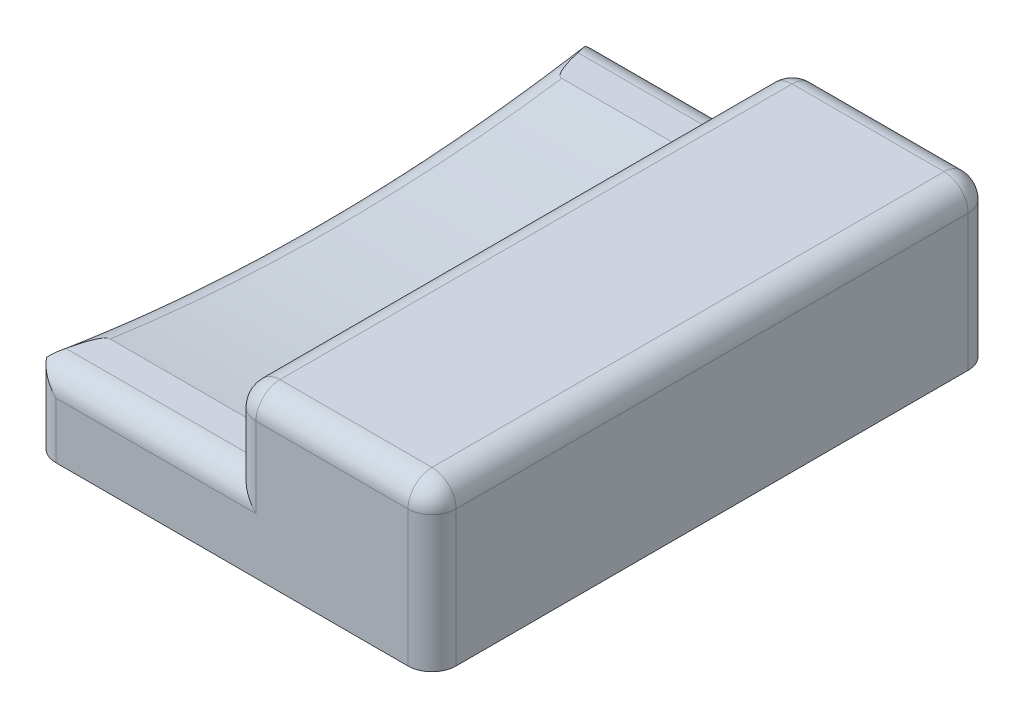
ISO-10303-21;
HEADER;
FILE_DESCRIPTION(('STEP AP214'),'2;1');
FILE_NAME('part.step','',(''),(''),'','','');
FILE_SCHEMA(('AUTOMOTIVE_DESIGN { 1 0 10303 214 1 1 1 1 }'));
ENDSEC;
DATA;
#1=APPLICATION_CONTEXT('core data for automotive mechanical design processes');
#2=APPLICATION_PROTOCOL_DEFINITION('international standard','automotive_design',2000,#1);
#3=PRODUCT_CONTEXT('',#1,'mechanical');
#4=PRODUCT('Part','Part','',(#3));
#5=PRODUCT_RELATED_PRODUCT_CATEGORY('part','',(#4));
#6=PRODUCT_DEFINITION_FORMATION('','',#4);
#7=PRODUCT_DEFINITION_CONTEXT('part definition',#1,'design');
#8=PRODUCT_DEFINITION('design','',#6,#7);
#9=PRODUCT_DEFINITION_SHAPE('','',#8);
#10=(LENGTH_UNIT() NAMED_UNIT(*) SI_UNIT(.MILLI.,.METRE.));
#11=(NAMED_UNIT(*) PLANE_ANGLE_UNIT() SI_UNIT($,.RADIAN.));
#12=(NAMED_UNIT(*) SI_UNIT($,.STERADIAN.) SOLID_ANGLE_UNIT());
#13=UNCERTAINTY_MEASURE_WITH_UNIT(LENGTH_MEASURE(1.E-05),#10,'distance_accuracy_value','');
#14=(GEOMETRIC_REPRESENTATION_CONTEXT(3) GLOBAL_UNCERTAINTY_ASSIGNED_CONTEXT((#13)) GLOBAL_UNIT_ASSIGNED_CONTEXT((#10,
#11,#12)) REPRESENTATION_CONTEXT('',''));
#15=CARTESIAN_POINT('',(0.,0.,0.));
#16=DIRECTION('',(0.,0.,1.));
#17=DIRECTION('',(1.,0.,0.));
#18=AXIS2_PLACEMENT_3D('',#15,#16,#17);
#19=CARTESIAN_POINT('',(0.,20.,0.));
#20=DIRECTION('',(0.,-1.,0.));
#21=DIRECTION('',(0.,0.,-1.));
#22=AXIS2_PLACEMENT_3D('',#19,#20,#21);
#23=PLANE('',#22);
#24=DIRECTION('',(0.,0.,-1.));
#25=VECTOR('',#24,1.);
#26=CARTESIAN_POINT('',(47.,20.,0.));
#27=LINE('',#26,#25);
#28=CARTESIAN_POINT('',(47.,20.,-3.));
#29=VERTEX_POINT('',#28);
#30=CARTESIAN_POINT('',(47.,20.,-67.));
#31=VERTEX_POINT('',#30);
#32=EDGE_CURVE('E351',#29,#31,#27,.T.);
#33=ORIENTED_EDGE('',*,*,#32,.T.);
#34=DIRECTION('',(-1.,0.,0.));
#35=VECTOR('',#34,1.);
#36=CARTESIAN_POINT('',(0.,20.,-67.));
#37=LINE('',#36,#35);
#38=CARTESIAN_POINT('',(28.,20.,-67.));
#39=VERTEX_POINT('',#38);
#40=EDGE_CURVE('E353',#31,#39,#37,.T.);
#41=ORIENTED_EDGE('',*,*,#40,.T.);
#42=DIRECTION('',(0.,0.,-1.));
#43=VECTOR('',#42,1.);
#44=CARTESIAN_POINT('',(28.,20.,0.));
#45=LINE('',#44,#43);
#46=CARTESIAN_POINT('',(28.,20.,-3.));
#47=VERTEX_POINT('',#46);
#48=EDGE_CURVE('E344',#39,#47,#45,.F.);
#49=ORIENTED_EDGE('',*,*,#48,.T.);
#50=DIRECTION('',(1.,0.,0.));
#51=VECTOR('',#50,1.);
#52=CARTESIAN_POINT('',(0.,20.,-3.));
#53=LINE('',#52,#51);
#54=EDGE_CURVE('E349',#47,#29,#53,.T.);
#55=ORIENTED_EDGE('',*,*,#54,.T.);
#56=EDGE_LOOP('',(#33,#41,#49,#55));
#57=FACE_BOUND('',#56,.T.);
#58=ADVANCED_FACE('F33',(#57),#23,.F.);
#59=CARTESIAN_POINT('',(0.,20.,0.));
#60=DIRECTION('',(1.,0.,0.));
#61=DIRECTION('',(0.,0.,-1.));
#62=AXIS2_PLACEMENT_3D('',#59,#60,#61);
#63=PLANE('',#62);
#64=DIRECTION('',(0.,0.,1.));
#65=VECTOR('',#64,1.);
#66=CARTESIAN_POINT('',(0.,0.,0.));
#67=LINE('',#66,#65);
#68=CARTESIAN_POINT('',(0.,0.,-67.));
#69=VERTEX_POINT('',#68);
#70=CARTESIAN_POINT('',(0.,0.,-3.));
#71=VERTEX_POINT('',#70);
#72=EDGE_CURVE('E173',#69,#71,#67,.T.);
#73=ORIENTED_EDGE('',*,*,#72,.T.);
#74=DIRECTION('',(0.,-1.,0.));
#75=VECTOR('',#74,1.);
#76=CARTESIAN_POINT('',(0.,20.,-3.));
#77=LINE('',#76,#75);
#78=CARTESIAN_POINT('',(0.,7.53803353254265,-3.));
#79=VERTEX_POINT('',#78);
#80=EDGE_CURVE('E52',#71,#79,#77,.F.);
#81=ORIENTED_EDGE('',*,*,#80,.T.);
#82=CARTESIAN_POINT('',(0.,208.,-35.));
#83=DIRECTION('',(1.,0.,0.));
#84=DIRECTION('',(0.,0.,-1.));
#85=AXIS2_PLACEMENT_3D('',#82,#83,#84);
#86=CIRCLE('',#85,203.);
#87=CARTESIAN_POINT('',(0.,7.53803353254265,-67.));
#88=VERTEX_POINT('',#87);
#89=EDGE_CURVE('E186',#79,#88,#86,.T.);
#90=ORIENTED_EDGE('',*,*,#89,.T.);
#91=DIRECTION('',(0.,-1.,0.));
#92=VECTOR('',#91,1.);
#93=CARTESIAN_POINT('',(0.,20.,-67.));
#94=LINE('',#93,#92);
#95=EDGE_CURVE('E178',#88,#69,#94,.T.);
#96=ORIENTED_EDGE('',*,*,#95,.T.);
#97=EDGE_LOOP('',(#73,#81,#90,#96));
#98=FACE_BOUND('',#97,.T.);
#99=ADVANCED_FACE('F177',(#98),#63,.F.);
#100=CARTESIAN_POINT('',(0.,20.,0.));
#101=DIRECTION('',(0.,0.,-1.));
#102=DIRECTION('',(-1.,0.,0.));
#103=AXIS2_PLACEMENT_3D('',#100,#101,#102);
#104=PLANE('',#103);
#105=DIRECTION('',(-1.,0.,0.));
#106=VECTOR('',#105,1.);
#107=CARTESIAN_POINT('',(0.,7.,0.));
#108=LINE('',#107,#106);
#109=CARTESIAN_POINT('',(28.,7.,0.));
#110=VERTEX_POINT('',#109);
#111=CARTESIAN_POINT('',(3.,7.,0.));
#112=VERTEX_POINT('',#111);
#113=EDGE_CURVE('E375',#110,#112,#108,.T.);
#114=ORIENTED_EDGE('',*,*,#113,.T.);
#115=DIRECTION('',(0.,-1.,0.));
#116=VECTOR('',#115,1.);
#117=CARTESIAN_POINT('',(3.,20.,0.));
#118=LINE('',#117,#116);
#119=CARTESIAN_POINT('',(3.,0.,0.));
#120=VERTEX_POINT('',#119);
#121=EDGE_CURVE('E377',#112,#120,#118,.T.);
#122=ORIENTED_EDGE('',*,*,#121,.T.);
#123=DIRECTION('',(1.,0.,0.));
#124=VECTOR('',#123,1.);
#125=CARTESIAN_POINT('',(0.,0.,0.));
#126=LINE('',#125,#124);
#127=CARTESIAN_POINT('',(47.,0.,0.));
#128=VERTEX_POINT('',#127);
#129=EDGE_CURVE('E176',#120,#128,#126,.T.);
#130=ORIENTED_EDGE('',*,*,#129,.T.);
#131=DIRECTION('',(0.,-1.,0.));
#132=VECTOR('',#131,1.);
#133=CARTESIAN_POINT('',(47.,20.,0.));
#134=LINE('',#133,#132);
#135=CARTESIAN_POINT('',(47.,17.,0.));
#136=VERTEX_POINT('',#135);
#137=EDGE_CURVE('E369',#128,#136,#134,.F.);
#138=ORIENTED_EDGE('',*,*,#137,.T.);
#139=DIRECTION('',(1.,0.,0.));
#140=VECTOR('',#139,1.);
#141=CARTESIAN_POINT('',(0.,17.,0.));
#142=LINE('',#141,#140);
#143=CARTESIAN_POINT('',(28.,17.,0.));
#144=VERTEX_POINT('',#143);
#145=EDGE_CURVE('E371',#136,#144,#142,.F.);
#146=ORIENTED_EDGE('',*,*,#145,.T.);
#147=DIRECTION('',(0.,1.,0.));
#148=VECTOR('',#147,1.);
#149=CARTESIAN_POINT('',(28.,10.,0.));
#150=LINE('',#149,#148);
#151=EDGE_CURVE('E373',#144,#110,#150,.F.);
#152=ORIENTED_EDGE('',*,*,#151,.T.);
#153=EDGE_LOOP('',(#114,#122,#130,#138,#146,#152));
#154=FACE_BOUND('',#153,.T.);
#155=ADVANCED_FACE('F288',(#154),#104,.F.);
#156=CARTESIAN_POINT('',(50.,20.,0.));
#157=DIRECTION('',(-1.,0.,0.));
#158=DIRECTION('',(0.,0.,1.));
#159=AXIS2_PLACEMENT_3D('',#156,#157,#158);
#160=PLANE('',#159);
#161=DIRECTION('',(0.,0.,-1.));
#162=VECTOR('',#161,1.);
#163=CARTESIAN_POINT('',(50.,0.,0.));
#164=LINE('',#163,#162);
#165=CARTESIAN_POINT('',(50.,0.,-3.));
#166=VERTEX_POINT('',#165);
#167=CARTESIAN_POINT('',(50.,0.,-67.));
#168=VERTEX_POINT('',#167);
#169=EDGE_CURVE('E336',#166,#168,#164,.T.);
#170=ORIENTED_EDGE('',*,*,#169,.T.);
#171=DIRECTION('',(0.,-1.,0.));
#172=VECTOR('',#171,1.);
#173=CARTESIAN_POINT('',(50.,20.,-67.));
#174=LINE('',#173,#172);
#175=CARTESIAN_POINT('',(50.,17.,-67.));
#176=VERTEX_POINT('',#175);
#177=EDGE_CURVE('E332',#168,#176,#174,.F.);
#178=ORIENTED_EDGE('',*,*,#177,.T.);
#179=DIRECTION('',(0.,0.,-1.));
#180=VECTOR('',#179,1.);
#181=CARTESIAN_POINT('',(50.,17.,0.));
#182=LINE('',#181,#180);
#183=CARTESIAN_POINT('',(50.,17.,-3.));
#184=VERTEX_POINT('',#183);
#185=EDGE_CURVE('E366',#176,#184,#182,.F.);
#186=ORIENTED_EDGE('',*,*,#185,.T.);
#187=DIRECTION('',(0.,-1.,0.));
#188=VECTOR('',#187,1.);
#189=CARTESIAN_POINT('',(50.,20.,-3.));
#190=LINE('',#189,#188);
#191=EDGE_CURVE('E342',#184,#166,#190,.T.);
#192=ORIENTED_EDGE('',*,*,#191,.T.);
#193=EDGE_LOOP('',(#170,#178,#186,#192));
#194=FACE_BOUND('',#193,.T.);
#195=ADVANCED_FACE('F284',(#194),#160,.F.);
#196=CARTESIAN_POINT('',(0.,20.,-70.));
#197=DIRECTION('',(0.,0.,1.));
#198=DIRECTION('',(1.,0.,0.));
#199=AXIS2_PLACEMENT_3D('',#196,#197,#198);
#200=PLANE('',#199);
#201=DIRECTION('',(-1.,0.,0.));
#202=VECTOR('',#201,1.);
#203=CARTESIAN_POINT('',(0.,0.,-70.));
#204=LINE('',#203,#202);
#205=CARTESIAN_POINT('',(47.,0.,-70.));
#206=VERTEX_POINT('',#205);
#207=CARTESIAN_POINT('',(3.,0.,-70.));
#208=VERTEX_POINT('',#207);
#209=EDGE_CURVE('E339',#206,#208,#204,.T.);
#210=ORIENTED_EDGE('',*,*,#209,.T.);
#211=DIRECTION('',(0.,-1.,0.));
#212=VECTOR('',#211,1.);
#213=CARTESIAN_POINT('',(3.,20.,-70.));
#214=LINE('',#213,#212);
#215=CARTESIAN_POINT('',(3.,7.,-70.));
#216=VERTEX_POINT('',#215);
#217=EDGE_CURVE('E363',#208,#216,#214,.F.);
#218=ORIENTED_EDGE('',*,*,#217,.T.);
#219=DIRECTION('',(-1.,0.,0.));
#220=VECTOR('',#219,1.);
#221=CARTESIAN_POINT('',(0.,7.,-70.));
#222=LINE('',#221,#220);
#223=CARTESIAN_POINT('',(28.,7.,-70.));
#224=VERTEX_POINT('',#223);
#225=EDGE_CURVE('E361',#216,#224,#222,.F.);
#226=ORIENTED_EDGE('',*,*,#225,.T.);
#227=DIRECTION('',(0.,-1.,0.));
#228=VECTOR('',#227,1.);
#229=CARTESIAN_POINT('',(28.,20.,-70.));
#230=LINE('',#229,#228);
#231=CARTESIAN_POINT('',(28.,17.,-70.));
#232=VERTEX_POINT('',#231);
#233=EDGE_CURVE('E359',#224,#232,#230,.F.);
#234=ORIENTED_EDGE('',*,*,#233,.T.);
#235=DIRECTION('',(-1.,0.,0.));
#236=VECTOR('',#235,1.);
#237=CARTESIAN_POINT('',(0.,17.,-70.));
#238=LINE('',#237,#236);
#239=CARTESIAN_POINT('',(47.,17.,-70.));
#240=VERTEX_POINT('',#239);
#241=EDGE_CURVE('E357',#232,#240,#238,.F.);
#242=ORIENTED_EDGE('',*,*,#241,.T.);
#243=DIRECTION('',(0.,-1.,0.));
#244=VECTOR('',#243,1.);
#245=CARTESIAN_POINT('',(47.,20.,-70.));
#246=LINE('',#245,#244);
#247=EDGE_CURVE('E330',#240,#206,#246,.T.);
#248=ORIENTED_EDGE('',*,*,#247,.T.);
#249=EDGE_LOOP('',(#210,#218,#226,#234,#242,#248));
#250=FACE_BOUND('',#249,.T.);
#251=ADVANCED_FACE('F281',(#250),#200,.F.);
#252=CARTESIAN_POINT('',(0.,0.,0.));
#253=DIRECTION('',(0.,-1.,0.));
#254=DIRECTION('',(0.,0.,-1.));
#255=AXIS2_PLACEMENT_3D('',#252,#253,#254);
#256=PLANE('',#255);
#257=ORIENTED_EDGE('',*,*,#129,.F.);
#258=CARTESIAN_POINT('',(3.,0.,-3.));
#259=DIRECTION('',(0.,-1.,0.));
#260=DIRECTION('',(0.,0.,-1.));
#261=AXIS2_PLACEMENT_3D('',#258,#259,#260);
#262=CIRCLE('',#261,3.);
#263=EDGE_CURVE('E11',#120,#71,#262,.T.);
#264=ORIENTED_EDGE('',*,*,#263,.T.);
#265=ORIENTED_EDGE('',*,*,#72,.F.);
#266=CARTESIAN_POINT('',(3.,0.,-67.));
#267=DIRECTION('',(0.,-1.,0.));
#268=DIRECTION('',(0.,0.,-1.));
#269=AXIS2_PLACEMENT_3D('',#266,#267,#268);
#270=CIRCLE('',#269,3.);
#271=EDGE_CURVE('E43',#69,#208,#270,.T.);
#272=ORIENTED_EDGE('',*,*,#271,.T.);
#273=ORIENTED_EDGE('',*,*,#209,.F.);
#274=CARTESIAN_POINT('',(47.,0.,-67.));
#275=DIRECTION('',(0.,-1.,0.));
#276=DIRECTION('',(0.,0.,-1.));
#277=AXIS2_PLACEMENT_3D('',#274,#275,#276);
#278=CIRCLE('',#277,3.);
#279=EDGE_CURVE('E188',#206,#168,#278,.T.);
#280=ORIENTED_EDGE('',*,*,#279,.T.);
#281=ORIENTED_EDGE('',*,*,#169,.F.);
#282=CARTESIAN_POINT('',(47.,0.,-3.));
#283=DIRECTION('',(0.,-1.,0.));
#284=DIRECTION('',(0.,0.,-1.));
#285=AXIS2_PLACEMENT_3D('',#282,#283,#284);
#286=CIRCLE('',#285,3.);
#287=EDGE_CURVE('E185',#166,#128,#286,.T.);
#288=ORIENTED_EDGE('',*,*,#287,.T.);
#289=EDGE_LOOP('',(#257,#264,#265,#272,#273,#280,#281,#288));
#290=FACE_BOUND('',#289,.T.);
#291=ADVANCED_FACE('F172',(#290),#256,.T.);
#292=CARTESIAN_POINT('',(25.,10.,-6.78652804066815));
#293=DIRECTION('',(0.,-1.,0.));
#294=DIRECTION('',(0.,0.,-1.));
#295=AXIS2_PLACEMENT_3D('',#292,#293,#294);
#296=PLANE('',#295);
#297=DIRECTION('',(-1.,0.,0.));
#298=VECTOR('',#297,1.);
#299=CARTESIAN_POINT('',(25.,10.,-6.78652804066815));
#300=LINE('',#299,#298);
#301=CARTESIAN_POINT('',(25.,10.,-6.78652804066815));
#302=VERTEX_POINT('',#301);
#303=CARTESIAN_POINT('',(3.,10.,-6.78652804066815));
#304=VERTEX_POINT('',#303);
#305=EDGE_CURVE('E179',#302,#304,#300,.T.);
#306=ORIENTED_EDGE('',*,*,#305,.T.);
#307=CARTESIAN_POINT('',(3.,10.,-6.78652804066815));
#308=CARTESIAN_POINT('',(2.97283767023564,10.,-6.78661603657435));
#309=CARTESIAN_POINT('',(2.94580219402082,10.,-6.78391685426819));
#310=CARTESIAN_POINT('',(2.89300564850904,10.,-6.77378992579364));
#311=CARTESIAN_POINT('',(2.86723202972162,10.,-6.76642897124706));
#312=CARTESIAN_POINT('',(2.80960341439848,10.,-6.74495909459089));
#313=CARTESIAN_POINT('',(2.77827087085583,10.,-6.72948161370137));
#314=CARTESIAN_POINT('',(2.7182941755811,10.,-6.69378518835798));
#315=CARTESIAN_POINT('',(2.68966780819925,10.,-6.67353757210311));
#316=CARTESIAN_POINT('',(2.61178291480033,10.,-6.61132868940785));
#317=CARTESIAN_POINT('',(2.56564294156609,10.,-6.56552764330699));
#318=CARTESIAN_POINT('',(2.47981348219681,10.,-6.46835344776558));
#319=CARTESIAN_POINT('',(2.44014210794988,10.,-6.4169653022757));
#320=CARTESIAN_POINT('',(2.33787110231278,10.,-6.27190757709554));
#321=CARTESIAN_POINT('',(2.27992768049093,10.,-6.17499474692295));
#322=CARTESIAN_POINT('',(2.17252568012461,10.,-5.97650659122865));
#323=CARTESIAN_POINT('',(2.12309006517863,10.,-5.87491955676449));
#324=CARTESIAN_POINT('',(2.02968253686925,10.,-5.66799914976688));
#325=CARTESIAN_POINT('',(1.98577307424686,10.,-5.56263773241506));
#326=CARTESIAN_POINT('',(1.9024650754644,10.,-5.3503438842432));
#327=CARTESIAN_POINT('',(1.8630604267874,10.,-5.24341380980297));
#328=CARTESIAN_POINT('',(1.78754811326613,10.,-5.02796766786654));
#329=CARTESIAN_POINT('',(1.7514529121765,10.,-4.91944725754414));
#330=CARTESIAN_POINT('',(1.68204327410568,10.,-4.70151720354438));
#331=CARTESIAN_POINT('',(1.64872908306333,10.,-4.59210748215766));
#332=CARTESIAN_POINT('',(1.55219160612783,10.,-4.26280127787498));
#333=CARTESIAN_POINT('',(1.49239780659943,10.,-4.04189971793224));
#334=CARTESIAN_POINT('',(1.37936058130509,10.,-3.5978761625082));
#335=CARTESIAN_POINT('',(1.32613376559537,10.,-3.37475001941122));
#336=CARTESIAN_POINT('',(1.2249869854251,10.,-2.92735052826522));
#337=CARTESIAN_POINT('',(1.17706596713405,10.,-2.70307741731675));
#338=CARTESIAN_POINT('',(1.08941206435251,10.,-2.27245748589464));
#339=CARTESIAN_POINT('',(1.04932955413873,10.,-2.06618127235464));
#340=CARTESIAN_POINT('',(0.972330775477108,10.,-1.65302662456499));
#341=CARTESIAN_POINT('',(0.935414710184256,10.,-1.44614815255433));
#342=CARTESIAN_POINT('',(0.86456279054743,10.,-1.03293815385267));
#343=CARTESIAN_POINT('',(0.830613081580195,10.,-0.826608992908559));
#344=CARTESIAN_POINT('',(0.765244403892852,10.,-0.413574310499643));
#345=CARTESIAN_POINT('',(0.733825140389053,10.,-0.206868835750714));
#346=CARTESIAN_POINT('',(0.703544247119797,10.,0.));
#347=B_SPLINE_CURVE_WITH_KNOTS('',3,(#307,#308,#309,#310,#311,#312,#313,#314,#315,#316,#317,
#318,#319,#320,#321,#322,#323,#324,#325,#326,#327,#328,#329,#330,#331,#332,#333,#334,#335,#336,
#337,#338,#339,#340,#341,#342,#343,#344,#345,#346),.UNSPECIFIED.,.F.,.F.,(4,2,2,2,2,2,2,2,2,2,2,
2,2,2,2,2,2,2,2,4),(0.,0.0811494733582297,0.161161795198234,0.265408286052778,0.370298119367736,
0.564244449667606,0.758724829978621,1.09657047745385,1.43531417694195,1.77759548339796,
2.11940669807651,2.46245644283548,2.80553649315702,3.49192434182628,4.18001416905984,
4.86796708269809,5.4983436138826,6.12876055900249,6.75605522475575,7.38327670793251),.UNSPECIFIED.);
#348=CARTESIAN_POINT('',(1.24182963864534,10.,-3.));
#349=VERTEX_POINT('',#348);
#350=EDGE_CURVE('E419',#304,#349,#347,.T.);
#351=ORIENTED_EDGE('',*,*,#350,.T.);
#352=DIRECTION('',(-1.,0.,0.));
#353=VECTOR('',#352,1.);
#354=CARTESIAN_POINT('',(25.,10.,-3.));
#355=LINE('',#354,#353);
#356=CARTESIAN_POINT('',(25.,10.,-3.));
#357=VERTEX_POINT('',#356);
#358=EDGE_CURVE('E415',#349,#357,#355,.F.);
#359=ORIENTED_EDGE('',*,*,#358,.T.);
#360=DIRECTION('',(0.,0.,1.));
#361=VECTOR('',#360,1.);
#362=CARTESIAN_POINT('',(25.,10.,-6.78652804066815));
#363=LINE('',#362,#361);
#364=EDGE_CURVE('E387',#302,#357,#363,.T.);
#365=ORIENTED_EDGE('',*,*,#364,.F.);
#366=EDGE_LOOP('',(#306,#351,#359,#365));
#367=FACE_BOUND('',#366,.T.);
#368=ADVANCED_FACE('F280',(#367),#296,.F.);
#369=CARTESIAN_POINT('',(25.,208.,-35.));
#370=DIRECTION('',(-1.,0.,0.));
#371=DIRECTION('',(0.,0.,1.));
#372=AXIS2_PLACEMENT_3D('',#369,#370,#371);
#373=CYLINDRICAL_SURFACE('',#372,200.);
#374=DIRECTION('',(-1.,0.,0.));
#375=VECTOR('',#374,1.);
#376=CARTESIAN_POINT('',(25.,10.,-63.2134719593319));
#377=LINE('',#376,#375);
#378=CARTESIAN_POINT('',(25.,10.,-63.2134719593319));
#379=VERTEX_POINT('',#378);
#380=CARTESIAN_POINT('',(3.,10.,-63.2134719593319));
#381=VERTEX_POINT('',#380);
#382=EDGE_CURVE('E409',#379,#381,#377,.T.);
#383=ORIENTED_EDGE('',*,*,#382,.T.);
#384=CARTESIAN_POINT('',(3.,208.,-35.));
#385=DIRECTION('',(1.,0.,0.));
#386=DIRECTION('',(0.,0.,-1.));
#387=AXIS2_PLACEMENT_3D('',#384,#385,#386);
#388=CIRCLE('',#387,200.);
#389=EDGE_CURVE('E414',#381,#304,#388,.F.);
#390=ORIENTED_EDGE('',*,*,#389,.T.);
#391=ORIENTED_EDGE('',*,*,#305,.F.);
#392=CARTESIAN_POINT('',(25.,208.,-35.));
#393=DIRECTION('',(-1.,0.,0.));
#394=DIRECTION('',(0.,0.,1.));
#395=AXIS2_PLACEMENT_3D('',#392,#393,#394);
#396=CIRCLE('',#395,200.);
#397=EDGE_CURVE('E411',#379,#302,#396,.T.);
#398=ORIENTED_EDGE('',*,*,#397,.F.);
#399=EDGE_LOOP('',(#383,#390,#391,#398));
#400=FACE_BOUND('',#399,.T.);
#401=ADVANCED_FACE('F272',(#400),#373,.F.);
#402=CARTESIAN_POINT('',(25.,10.,-70.));
#403=DIRECTION('',(0.,-1.,0.));
#404=DIRECTION('',(0.,0.,-1.));
#405=AXIS2_PLACEMENT_3D('',#402,#403,#404);
#406=PLANE('',#405);
#407=DIRECTION('',(0.,0.,1.));
#408=VECTOR('',#407,1.);
#409=CARTESIAN_POINT('',(25.,10.,-70.));
#410=LINE('',#409,#408);
#411=CARTESIAN_POINT('',(25.,10.,-67.));
#412=VERTEX_POINT('',#411);
#413=EDGE_CURVE('E78',#412,#379,#410,.T.);
#414=ORIENTED_EDGE('',*,*,#413,.F.);
#415=DIRECTION('',(-1.,0.,0.));
#416=VECTOR('',#415,1.);
#417=CARTESIAN_POINT('',(25.,10.,-67.));
#418=LINE('',#417,#416);
#419=CARTESIAN_POINT('',(1.24182963864531,10.,-67.));
#420=VERTEX_POINT('',#419);
#421=EDGE_CURVE('E262',#412,#420,#418,.T.);
#422=ORIENTED_EDGE('',*,*,#421,.T.);
#423=CARTESIAN_POINT('',(0.703544247119774,10.,-70.));
#424=CARTESIAN_POINT('',(0.738889751628962,10.,-69.7585972411166));
#425=CARTESIAN_POINT('',(0.775772333086899,10.,-69.517412815705));
#426=CARTESIAN_POINT('',(0.853051724983094,10.,-69.0354981915219));
#427=CARTESIAN_POINT('',(0.89345009790264,10.,-68.7947682437861));
#428=CARTESIAN_POINT('',(0.978815371367867,10.,-68.3103355142689));
#429=CARTESIAN_POINT('',(1.02384247226395,10.,-68.0666432840409));
#430=CARTESIAN_POINT('',(1.11860353964783,10.,-67.5802548583238));
#431=CARTESIAN_POINT('',(1.16833591179811,10.,-67.3375583543183));
#432=CARTESIAN_POINT('',(1.27578837131271,10.,-66.8429608689673));
#433=CARTESIAN_POINT('',(1.33376044643477,10.,-66.5911143288256));
#434=CARTESIAN_POINT('',(1.45775189597145,10.,-66.0890977675977));
#435=CARTESIAN_POINT('',(1.52377927920613,10.,-65.838929680237));
#436=CARTESIAN_POINT('',(1.630992582249,10.,-65.4669470123747));
#437=CARTESIAN_POINT('',(1.66795143830759,10.,-65.3439152194062));
#438=CARTESIAN_POINT('',(1.74530416995692,10.,-65.0989414610632));
#439=CARTESIAN_POINT('',(1.78569762352677,10.,-64.9769993638232));
#440=CARTESIAN_POINT('',(1.87079882984268,10.,-64.7348419104917));
#441=CARTESIAN_POINT('',(1.91549955973691,10.,-64.6146240988054));
#442=CARTESIAN_POINT('',(2.01072012919107,10.,-64.3765330079379));
#443=CARTESIAN_POINT('',(2.0612364084338,10.,-64.2586583455599));
#444=CARTESIAN_POINT('',(2.13183843587036,10.,-64.1091776698356));
#445=CARTESIAN_POINT('',(2.14806244320511,10.,-64.0757457780356));
#446=CARTESIAN_POINT('',(2.18133176336422,10.,-64.009286385595));
#447=CARTESIAN_POINT('',(2.19837724058061,10.,-63.9762589675699));
#448=CARTESIAN_POINT('',(2.25101258940976,10.,-63.8777100580281));
#449=CARTESIAN_POINT('',(2.28801008835622,10.,-63.8129188524907));
#450=CARTESIAN_POINT('',(2.3700062327303,10.,-63.6816376285934));
#451=CARTESIAN_POINT('',(2.41539926555757,10.,-63.6153927269935));
#452=CARTESIAN_POINT('',(2.51452331391885,10.,-63.4894570068946));
#453=CARTESIAN_POINT('',(2.56820928626041,10.,-63.4297335936122));
#454=CARTESIAN_POINT('',(2.65265070956419,10.,-63.3554513658835));
#455=CARTESIAN_POINT('',(2.67820217892395,10.,-63.3350633067508));
#456=CARTESIAN_POINT('',(2.73173042034892,10.,-63.2976941113008));
#457=CARTESIAN_POINT('',(2.75970564519636,10.,-63.2807108241454));
#458=CARTESIAN_POINT('',(2.8127934974033,10.,-63.2542132804971));
#459=CARTESIAN_POINT('',(2.8375019120717,10.,-63.2439024699125));
#460=CARTESIAN_POINT('',(2.88824718867137,10.,-63.2274787262937));
#461=CARTESIAN_POINT('',(2.91427986208371,10.,-63.2213533462099));
#462=CARTESIAN_POINT('',(2.96029581322912,10.,-63.2148625346229));
#463=CARTESIAN_POINT('',(2.98013452389799,10.,-63.2134286752728));
#464=CARTESIAN_POINT('',(2.99999999999999,10.,-63.2134719593318));
#465=B_SPLINE_CURVE_WITH_KNOTS('',3,(#423,#424,#425,#426,#427,#428,#429,#430,#431,#432,#433,
#434,#435,#436,#437,#438,#439,#440,#441,#442,#443,#444,#445,#446,#447,#448,#449,#450,#451,#452,
#453,#454,#455,#456,#457,#458,#459,#460,#461,#462,#463,#464),.UNSPECIFIED.,.F.,.F.,(4,2,2,2,2,2,
2,2,2,2,2,2,2,2,2,2,2,2,2,2,4),(0.,0.731934785029254,1.46419653264036,2.20760891438859,
2.95077029378363,3.72598213443626,4.5019710921966,4.88732433372946,5.27263029381067,
5.65731832795693,6.0417720935913,6.1532435668349,6.26473744107079,6.48837572314024,
6.72901030968594,6.96838108315407,7.06625756942723,7.16407202967474,7.24410359296306,
7.32389610228147,7.38340365102513),.UNSPECIFIED.);
#466=EDGE_CURVE('E255',#420,#381,#465,.T.);
#467=ORIENTED_EDGE('',*,*,#466,.T.);
#468=ORIENTED_EDGE('',*,*,#382,.F.);
#469=EDGE_LOOP('',(#414,#422,#467,#468));
#470=FACE_BOUND('',#469,.T.);
#471=ADVANCED_FACE('F266',(#470),#406,.F.);
#472=CARTESIAN_POINT('',(25.,208.,-35.));
#473=DIRECTION('',(-1.,0.,0.));
#474=DIRECTION('',(0.,0.,1.));
#475=AXIS2_PLACEMENT_3D('',#472,#473,#474);
#476=PLANE('',#475);
#477=ORIENTED_EDGE('',*,*,#364,.T.);
#478=DIRECTION('',(0.,1.,0.));
#479=VECTOR('',#478,1.);
#480=CARTESIAN_POINT('',(25.,20.,-3.));
#481=LINE('',#480,#479);
#482=CARTESIAN_POINT('',(25.,17.,-3.));
#483=VERTEX_POINT('',#482);
#484=EDGE_CURVE('E263',#357,#483,#481,.T.);
#485=ORIENTED_EDGE('',*,*,#484,.T.);
#486=DIRECTION('',(0.,0.,-1.));
#487=VECTOR('',#486,1.);
#488=CARTESIAN_POINT('',(25.,17.,-70.));
#489=LINE('',#488,#487);
#490=CARTESIAN_POINT('',(25.,17.,-67.));
#491=VERTEX_POINT('',#490);
#492=EDGE_CURVE('E380',#483,#491,#489,.T.);
#493=ORIENTED_EDGE('',*,*,#492,.T.);
#494=DIRECTION('',(0.,-1.,0.));
#495=VECTOR('',#494,1.);
#496=CARTESIAN_POINT('',(25.,10.,-67.));
#497=LINE('',#496,#495);
#498=EDGE_CURVE('E379',#491,#412,#497,.T.);
#499=ORIENTED_EDGE('',*,*,#498,.T.);
#500=ORIENTED_EDGE('',*,*,#413,.T.);
#501=ORIENTED_EDGE('',*,*,#397,.T.);
#502=EDGE_LOOP('',(#477,#485,#493,#499,#500,#501));
#503=FACE_BOUND('',#502,.T.);
#504=ADVANCED_FACE('F271',(#503),#476,.T.);
#505=CARTESIAN_POINT('',(0.,7.,-3.));
#506=DIRECTION('',(-1.,0.,0.));
#507=DIRECTION('',(0.,0.,1.));
#508=AXIS2_PLACEMENT_3D('',#505,#506,#507);
#509=CYLINDRICAL_SURFACE('',#508,3.);
#510=CARTESIAN_POINT('',(3.,7.,-3.));
#511=DIRECTION('',(-0.707106781186547,-0.707106781186547,0.));
#512=DIRECTION('',(0.707106781186547,-0.707106781186547,0.));
#513=AXIS2_PLACEMENT_3D('',#510,#511,#512);
#514=ELLIPSE('',#513,4.24264068711928,3.);
#515=CARTESIAN_POINT('',(0.503027814376875,9.49697218562314,-1.33713202441551));
#516=VERTEX_POINT('',#515);
#517=EDGE_CURVE('E37',#112,#516,#514,.T.);
#518=ORIENTED_EDGE('',*,*,#517,.F.);
#519=ORIENTED_EDGE('',*,*,#113,.F.);
#520=CARTESIAN_POINT('',(28.,7.00000000000001,-3.));
#521=DIRECTION('',(-0.707106781186547,-0.707106781186547,0.));
#522=DIRECTION('',(0.707106781186547,-0.707106781186547,0.));
#523=AXIS2_PLACEMENT_3D('',#520,#521,#522);
#524=ELLIPSE('',#523,4.24264068711928,3.);
#525=EDGE_CURVE('E449',#357,#110,#524,.F.);
#526=ORIENTED_EDGE('',*,*,#525,.F.);
#527=ORIENTED_EDGE('',*,*,#358,.F.);
#528=CARTESIAN_POINT('',(0.180429303343831,6.99980000000001,-6.66666676728058E-09));
#529=CARTESIAN_POINT('',(0.159525010255182,7.05815973001871,1.28456333311141E-05));
#530=CARTESIAN_POINT('',(0.140304154996887,7.11713553121339,-0.00169517853084892));
#531=CARTESIAN_POINT('',(0.105389961428289,7.23593359886854,-0.00870198136551779));
#532=CARTESIAN_POINT('',(0.0896979183516294,7.29575616759524,-0.014002075632524));
#533=CARTESIAN_POINT('',(0.0620446095041402,7.41570138290115,-0.0283282315768932));
#534=CARTESIAN_POINT('',(0.0500761112460048,7.47582321436044,-0.0373469899632352));
#535=CARTESIAN_POINT('',(0.0299275250507344,7.59598968856709,-0.0591610689617072));
#536=CARTESIAN_POINT('',(0.0217468066806156,7.65603434249958,-0.0719557605317402));
#537=CARTESIAN_POINT('',(0.00293911879646883,7.83566415872629,-0.116108880852482));
#538=CARTESIAN_POINT('',(-0.00190815798238913,7.95454812955824,-0.153213430107408));
#539=CARTESIAN_POINT('',(0.00327113240371385,8.18633566245479,-0.241733799655928));
#540=CARTESIAN_POINT('',(0.0132913938890747,8.29924173885651,-0.293143545260362));
#541=CARTESIAN_POINT('',(0.0462543741191479,8.51454913704604,-0.407556055498578));
#542=CARTESIAN_POINT('',(0.0689858400307143,8.6170906319582,-0.470358242449893));
#543=CARTESIAN_POINT('',(0.125080549963683,8.81201986271232,-0.606106314235699));
#544=CARTESIAN_POINT('',(0.158451494928275,8.90440017846395,-0.679059524842984));
#545=CARTESIAN_POINT('',(0.249948077526532,9.11612220653222,-0.866957339971684));
#546=CARTESIAN_POINT('',(0.312520407488831,9.22962513694851,-0.986328822464107));
#547=CARTESIAN_POINT('',(0.448362051317727,9.43362712101603,-1.23821370213089));
#548=CARTESIAN_POINT('',(0.521663550622451,9.52405463138344,-1.37076624222938));
#549=CARTESIAN_POINT('',(0.674155802459686,9.68382708476722,-1.64963970149682));
#550=CARTESIAN_POINT('',(0.753439979370344,9.75267061782251,-1.79619740486514));
#551=CARTESIAN_POINT('',(0.869443248626467,9.83784192100959,-2.02370280519774));
#552=CARTESIAN_POINT('',(0.907557910258012,9.86318726553828,-2.10067082902228));
#553=CARTESIAN_POINT('',(0.981555484642029,9.90777492871688,-2.25738052625607));
#554=CARTESIAN_POINT('',(1.01743927515996,9.92701966010727,-2.33712108926904));
#555=CARTESIAN_POINT('',(1.0903357064391,9.96145817333012,-2.51136937184819));
#556=CARTESIAN_POINT('',(1.1267539197491,9.97565615613019,-2.60633848469492));
#557=CARTESIAN_POINT('',(1.19139978719468,9.9949377502988,-2.80035868835716));
#558=CARTESIAN_POINT('',(1.21958844527485,9.99997854004674,-2.89942675282084));
#559=CARTESIAN_POINT('',(1.24187374723736,9.99999999333334,-3.00019999999998));
#560=B_SPLINE_CURVE_WITH_KNOTS('',3,(#528,#529,#530,#531,#532,#533,#534,#535,#536,#537,#538,
#539,#540,#541,#542,#543,#544,#545,#546,#547,#548,#549,#550,#551,#552,#553,#554,#555,#556,#557,
#558,#559),.UNSPECIFIED.,.F.,.F.,(4,2,2,2,2,2,2,2,2,2,2,2,2,2,2,4),(0.,0.185939843881427,
0.371947825102221,0.557592221901368,0.743205709180259,1.11503479471322,1.48670622368388,
1.85237679663489,2.21831264816055,2.74402040210013,3.27133878771036,3.81012816640684,
4.07855918634656,4.34688391127362,4.65422124389864,4.96299210902119),.UNSPECIFIED.);
#561=EDGE_CURVE('E444',#516,#349,#560,.T.);
#562=ORIENTED_EDGE('',*,*,#561,.F.);
#563=EDGE_LOOP('',(#518,#519,#526,#527,#562));
#564=FACE_BOUND('',#563,.T.);
#565=ADVANCED_FACE('F429',(#564),#509,.T.);
#566=CARTESIAN_POINT('',(3.,20.,-3.));
#567=DIRECTION('',(0.,-1.,0.));
#568=DIRECTION('',(0.,0.,-1.));
#569=AXIS2_PLACEMENT_3D('',#566,#567,#568);
#570=CYLINDRICAL_SURFACE('',#569,3.);
#571=ORIENTED_EDGE('',*,*,#121,.F.);
#572=ORIENTED_EDGE('',*,*,#517,.T.);
#573=CARTESIAN_POINT('',(0.,7.53803353254266,-3.));
#574=CARTESIAN_POINT('',(3.59955517273945E-09,7.54082909072866,-2.99761530585066));
#575=CARTESIAN_POINT('',(2.84684169499415E-06,7.54362469914951,-2.99523061888235));
#576=CARTESIAN_POINT('',(0.000309849212943147,7.69464235001287,-2.86641348294648));
#577=CARTESIAN_POINT('',(0.00859441183054296,7.84299442123316,-2.74001067788662));
#578=CARTESIAN_POINT('',(0.0412564961741832,8.13890948172607,-2.48815656153868));
#579=CARTESIAN_POINT('',(0.0656483118688402,8.28647165266011,-2.36270619557931));
#580=CARTESIAN_POINT('',(0.131008332713953,8.57963777916972,-2.1137433789809));
#581=CARTESIAN_POINT('',(0.171979097060197,8.72524142883276,-1.9902312305923));
#582=CARTESIAN_POINT('',(0.271297094668967,9.01298909561839,-1.74640390314251));
#583=CARTESIAN_POINT('',(0.329629217550917,9.15513600540103,-1.62608604272671));
#584=CARTESIAN_POINT('',(0.456779119836653,9.41745803962233,-1.40427854994485));
#585=CARTESIAN_POINT('',(0.523475751582173,9.53821141390494,-1.30227158308484));
#586=CARTESIAN_POINT('',(0.635149580080389,9.71504713554764,-1.15301925789142));
#587=CARTESIAN_POINT('',(0.6743009166015,9.77326241096749,-1.1039068347496));
#588=CARTESIAN_POINT('',(0.756690394643922,9.88804466757522,-1.00711391702817));
#589=CARTESIAN_POINT('',(0.799931144691457,9.94461056616518,-0.959434362335064));
#590=CARTESIAN_POINT('',(0.845295709085594,10.0002,-0.912597446893618));
#591=B_SPLINE_CURVE_WITH_KNOTS('',3,(#573,#574,#575,#576,#577,#578,#579,#580,#581,#582,#583,
#584,#585,#586,#587,#588,#589,#590),.UNSPECIFIED.,.F.,.F.,(4,2,2,2,2,2,2,2,4),(0.,
0.0110235830627793,0.595479699759116,1.18045517531047,1.76552098458825,2.35007906615432,
2.86394500670951,3.12074755458219,3.37771502912307),.UNSPECIFIED.);
#592=EDGE_CURVE('E183',#79,#516,#591,.T.);
#593=ORIENTED_EDGE('',*,*,#592,.F.);
#594=ORIENTED_EDGE('',*,*,#80,.F.);
#595=ORIENTED_EDGE('',*,*,#263,.F.);
#596=EDGE_LOOP('',(#571,#572,#593,#594,#595));
#597=FACE_BOUND('',#596,.T.);
#598=ADVANCED_FACE('F181',(#597),#570,.T.);
#599=CARTESIAN_POINT('',(47.,20.,-3.));
#600=DIRECTION('',(0.,-1.,0.));
#601=DIRECTION('',(0.,0.,-1.));
#602=AXIS2_PLACEMENT_3D('',#599,#600,#601);
#603=CYLINDRICAL_SURFACE('',#602,3.);
#604=ORIENTED_EDGE('',*,*,#287,.F.);
#605=ORIENTED_EDGE('',*,*,#191,.F.);
#606=CARTESIAN_POINT('',(47.,17.,-3.));
#607=DIRECTION('',(0.,1.,0.));
#608=DIRECTION('',(0.,0.,1.));
#609=AXIS2_PLACEMENT_3D('',#606,#607,#608);
#610=CIRCLE('',#609,3.);
#611=EDGE_CURVE('E468',#136,#184,#610,.T.);
#612=ORIENTED_EDGE('',*,*,#611,.F.);
#613=ORIENTED_EDGE('',*,*,#137,.F.);
#614=EDGE_LOOP('',(#604,#605,#612,#613));
#615=FACE_BOUND('',#614,.T.);
#616=ADVANCED_FACE('F35',(#615),#603,.T.);
#617=CARTESIAN_POINT('',(0.,17.,-3.));
#618=DIRECTION('',(1.,0.,0.));
#619=DIRECTION('',(0.,0.,-1.));
#620=AXIS2_PLACEMENT_3D('',#617,#618,#619);
#621=CYLINDRICAL_SURFACE('',#620,3.);
#622=CARTESIAN_POINT('',(28.,17.,-3.));
#623=DIRECTION('',(-1.,0.,0.));
#624=DIRECTION('',(0.,0.,1.));
#625=AXIS2_PLACEMENT_3D('',#622,#623,#624);
#626=CIRCLE('',#625,3.);
#627=EDGE_CURVE('E397',#144,#47,#626,.T.);
#628=ORIENTED_EDGE('',*,*,#627,.F.);
#629=ORIENTED_EDGE('',*,*,#145,.F.);
#630=CARTESIAN_POINT('',(47.,17.,-3.));
#631=DIRECTION('',(1.,0.,0.));
#632=DIRECTION('',(0.,0.,-1.));
#633=AXIS2_PLACEMENT_3D('',#630,#631,#632);
#634=CIRCLE('',#633,3.);
#635=EDGE_CURVE('E464',#29,#136,#634,.T.);
#636=ORIENTED_EDGE('',*,*,#635,.F.);
#637=ORIENTED_EDGE('',*,*,#54,.F.);
#638=EDGE_LOOP('',(#628,#629,#636,#637));
#639=FACE_BOUND('',#638,.T.);
#640=ADVANCED_FACE('F461',(#639),#621,.T.);
#641=CARTESIAN_POINT('',(28.,208.,-3.));
#642=DIRECTION('',(0.,-1.,0.));
#643=DIRECTION('',(0.,0.,-1.));
#644=AXIS2_PLACEMENT_3D('',#641,#642,#643);
#645=CYLINDRICAL_SURFACE('',#644,3.);
#646=ORIENTED_EDGE('',*,*,#525,.T.);
#647=ORIENTED_EDGE('',*,*,#151,.F.);
#648=CARTESIAN_POINT('',(28.,17.,-3.));
#649=DIRECTION('',(0.,1.,0.));
#650=DIRECTION('',(0.,0.,1.));
#651=AXIS2_PLACEMENT_3D('',#648,#649,#650);
#652=CIRCLE('',#651,3.);
#653=EDGE_CURVE('E230',#483,#144,#652,.T.);
#654=ORIENTED_EDGE('',*,*,#653,.F.);
#655=ORIENTED_EDGE('',*,*,#484,.F.);
#656=EDGE_LOOP('',(#646,#647,#654,#655));
#657=FACE_BOUND('',#656,.T.);
#658=ADVANCED_FACE('F239',(#657),#645,.T.);
#659=CARTESIAN_POINT('',(3.,208.,-35.));
#660=DIRECTION('',(1.,0.,0.));
#661=DIRECTION('',(0.,0.,-1.));
#662=AXIS2_PLACEMENT_3D('',#659,#660,#661);
#663=TOROIDAL_SURFACE('',#662,203.,3.);
#664=CARTESIAN_POINT('',(0.,7.53803353254266,-67.));
#665=CARTESIAN_POINT('',(3.59955513316018E-09,7.54082909072865,-67.0023846941493));
#666=CARTESIAN_POINT('',(2.84684169495594E-06,7.5436246991495,-67.0047693811177));
#667=CARTESIAN_POINT('',(0.000309849212943185,7.69464235001284,-67.1335865170536));
#668=CARTESIAN_POINT('',(0.0085944118305431,7.84299442123315,-67.2599893221134));
#669=CARTESIAN_POINT('',(0.0412564961741862,8.13890948172608,-67.5118434384613));
#670=CARTESIAN_POINT('',(0.0656483118688466,8.28647165266011,-67.6372938044207));
#671=CARTESIAN_POINT('',(0.131008332713966,8.57963777916972,-67.8862566210191));
#672=CARTESIAN_POINT('',(0.171979097060213,8.72524142883277,-68.0097687694077));
#673=CARTESIAN_POINT('',(0.271297094668983,9.01298909561841,-68.2535960968575));
#674=CARTESIAN_POINT('',(0.32962921755093,9.15513600540106,-68.3739139572733));
#675=CARTESIAN_POINT('',(0.456779119836672,9.41745803962235,-68.5957214500552));
#676=CARTESIAN_POINT('',(0.523475751582199,9.53821141390494,-68.6977284169152));
#677=CARTESIAN_POINT('',(0.635149580080409,9.71504713554764,-68.8469807421086));
#678=CARTESIAN_POINT('',(0.674300916601515,9.7732624109675,-68.8960931652504));
#679=CARTESIAN_POINT('',(0.75669039464393,9.88804466757524,-68.9928860829718));
#680=CARTESIAN_POINT('',(0.799931144691461,9.94461056616521,-69.0405656376649));
#681=CARTESIAN_POINT('',(0.845295709085598,10.0002,-69.0874025531064));
#682=B_SPLINE_CURVE_WITH_KNOTS('',3,(#664,#665,#666,#667,#668,#669,#670,#671,#672,#673,#674,
#675,#676,#677,#678,#679,#680,#681),.UNSPECIFIED.,.F.,.F.,(4,2,2,2,2,2,2,2,4),(0.,
0.0110235830627816,0.595479699759119,1.1804551753105,1.76552098458829,2.35007906615436,
2.86394500670953,3.12074755458221,3.37771502912308),.UNSPECIFIED.);
#683=CARTESIAN_POINT('',(0.503027814380883,9.49697218561912,-68.6628679755905));
#684=VERTEX_POINT('',#683);
#685=EDGE_CURVE('E63',#88,#684,#682,.T.);
#686=ORIENTED_EDGE('',*,*,#685,.F.);
#687=ORIENTED_EDGE('',*,*,#89,.F.);
#688=ORIENTED_EDGE('',*,*,#592,.T.);
#689=ORIENTED_EDGE('',*,*,#561,.T.);
#690=ORIENTED_EDGE('',*,*,#350,.F.);
#691=ORIENTED_EDGE('',*,*,#389,.F.);
#692=ORIENTED_EDGE('',*,*,#466,.F.);
#693=CARTESIAN_POINT('',(0.180429303343831,6.9998,-69.9999999933333));
#694=CARTESIAN_POINT('',(0.159525010255181,7.0581597300187,-70.0000128456333));
#695=CARTESIAN_POINT('',(0.140304154996887,7.11713553121339,-69.9983048214691));
#696=CARTESIAN_POINT('',(0.105389961428289,7.23593359886854,-69.9912980186345));
#697=CARTESIAN_POINT('',(0.0896979183516294,7.29575616759524,-69.9859979243675));
#698=CARTESIAN_POINT('',(0.0620446095041402,7.41570138290115,-69.9716717684231));
#699=CARTESIAN_POINT('',(0.0500761112460047,7.47582321436044,-69.9626530100368));
#700=CARTESIAN_POINT('',(0.0299275250507343,7.59598968856709,-69.9408389310383));
#701=CARTESIAN_POINT('',(0.0217468066806155,7.65603434249957,-69.9280442394683));
#702=CARTESIAN_POINT('',(0.00293911879646865,7.83566415872629,-69.8838911191475));
#703=CARTESIAN_POINT('',(-0.00190815798238962,7.95454812955824,-69.8467865698926));
#704=CARTESIAN_POINT('',(0.00327113240371351,8.18633566245479,-69.7582662003441));
#705=CARTESIAN_POINT('',(0.0132913938890748,8.29924173885651,-69.7068564547396));
#706=CARTESIAN_POINT('',(0.0462543741191482,8.51454913704604,-69.5924439445014));
#707=CARTESIAN_POINT('',(0.0689858400307144,8.61709063195819,-69.5296417575501));
#708=CARTESIAN_POINT('',(0.125080549963683,8.81201986271231,-69.3938936857643));
#709=CARTESIAN_POINT('',(0.158451494928275,8.90440017846395,-69.320940475157));
#710=CARTESIAN_POINT('',(0.249948077526532,9.11612220653222,-69.1330426600283));
#711=CARTESIAN_POINT('',(0.312520407488832,9.22962513694851,-69.0136711775359));
#712=CARTESIAN_POINT('',(0.448362051317727,9.43362712101602,-68.7617862978691));
#713=CARTESIAN_POINT('',(0.521663550622449,9.52405463138344,-68.6292337577706));
#714=CARTESIAN_POINT('',(0.674155802459682,9.68382708476722,-68.3503602985032));
#715=CARTESIAN_POINT('',(0.753439979370339,9.75267061782251,-68.2038025951348));
#716=CARTESIAN_POINT('',(0.869443248626467,9.83784192100959,-67.9762971948023));
#717=CARTESIAN_POINT('',(0.907557910258012,9.86318726553828,-67.8993291709777));
#718=CARTESIAN_POINT('',(0.981555484642029,9.90777492871688,-67.7426194737439));
#719=CARTESIAN_POINT('',(1.01743927515996,9.92701966010727,-67.662878910731));
#720=CARTESIAN_POINT('',(1.0903357064391,9.96145817333011,-67.4886306281518));
#721=CARTESIAN_POINT('',(1.1267539197491,9.97565615613018,-67.3936615153051));
#722=CARTESIAN_POINT('',(1.19139978719468,9.99493775029879,-67.1996413116428));
#723=CARTESIAN_POINT('',(1.21958844527485,9.99997854004674,-67.1005732471792));
#724=CARTESIAN_POINT('',(1.24187374723736,9.99999999333334,-66.9998));
#725=B_SPLINE_CURVE_WITH_KNOTS('',3,(#693,#694,#695,#696,#697,#698,#699,#700,#701,#702,#703,
#704,#705,#706,#707,#708,#709,#710,#711,#712,#713,#714,#715,#716,#717,#718,#719,#720,#721,#722,
#723,#724),.UNSPECIFIED.,.F.,.F.,(4,2,2,2,2,2,2,2,2,2,2,2,2,2,2,4),(0.,0.185939843881425,
0.371947825102219,0.557592221901367,0.743205709180258,1.11503479471322,1.48670622368388,
1.85237679663489,2.21831264816055,2.74402040210013,3.27133878771036,3.81012816640684,
4.07855918634656,4.34688391127361,4.65422124389863,4.96299210902118),.UNSPECIFIED.);
#726=EDGE_CURVE('E222',#684,#420,#725,.T.);
#727=ORIENTED_EDGE('',*,*,#726,.F.);
#728=EDGE_LOOP('',(#686,#687,#688,#689,#690,#691,#692,#727));
#729=FACE_BOUND('',#728,.T.);
#730=ADVANCED_FACE('F234',(#729),#663,.T.);
#731=CARTESIAN_POINT('',(3.,20.,-67.));
#732=DIRECTION('',(0.,-1.,0.));
#733=DIRECTION('',(0.,0.,-1.));
#734=AXIS2_PLACEMENT_3D('',#731,#732,#733);
#735=CYLINDRICAL_SURFACE('',#734,3.);
#736=ORIENTED_EDGE('',*,*,#95,.F.);
#737=ORIENTED_EDGE('',*,*,#685,.T.);
#738=CARTESIAN_POINT('',(3.,7.,-67.));
#739=DIRECTION('',(-0.707106781186547,-0.707106781186547,0.));
#740=DIRECTION('',(0.707106781186547,-0.707106781186547,0.));
#741=AXIS2_PLACEMENT_3D('',#738,#739,#740);
#742=ELLIPSE('',#741,4.24264068711928,3.);
#743=EDGE_CURVE('E219',#216,#684,#742,.F.);
#744=ORIENTED_EDGE('',*,*,#743,.F.);
#745=ORIENTED_EDGE('',*,*,#217,.F.);
#746=ORIENTED_EDGE('',*,*,#271,.F.);
#747=EDGE_LOOP('',(#736,#737,#744,#745,#746));
#748=FACE_BOUND('',#747,.T.);
#749=ADVANCED_FACE('F238',(#748),#735,.T.);
#750=CARTESIAN_POINT('',(47.,17.,-3.));
#751=DIRECTION('',(0.,0.,1.));
#752=DIRECTION('',(1.,0.,0.));
#753=AXIS2_PLACEMENT_3D('',#750,#751,#752);
#754=SPHERICAL_SURFACE('',#753,3.);
#755=ORIENTED_EDGE('',*,*,#635,.T.);
#756=ORIENTED_EDGE('',*,*,#611,.T.);
#757=CARTESIAN_POINT('',(47.,17.,-3.));
#758=DIRECTION('',(0.,0.,1.));
#759=DIRECTION('',(1.,0.,0.));
#760=AXIS2_PLACEMENT_3D('',#757,#758,#759);
#761=CIRCLE('',#760,3.);
#762=EDGE_CURVE('E216',#29,#184,#761,.F.);
#763=ORIENTED_EDGE('',*,*,#762,.F.);
#764=EDGE_LOOP('',(#755,#756,#763));
#765=FACE_BOUND('',#764,.T.);
#766=ADVANCED_FACE('F470',(#765),#754,.T.);
#767=CARTESIAN_POINT('',(28.,17.,-3.));
#768=DIRECTION('',(0.,0.,1.));
#769=DIRECTION('',(1.,0.,0.));
#770=AXIS2_PLACEMENT_3D('',#767,#768,#769);
#771=SPHERICAL_SURFACE('',#770,3.);
#772=ORIENTED_EDGE('',*,*,#653,.T.);
#773=ORIENTED_EDGE('',*,*,#627,.T.);
#774=CARTESIAN_POINT('',(28.,17.,-3.));
#775=DIRECTION('',(0.,0.,1.));
#776=DIRECTION('',(1.,0.,0.));
#777=AXIS2_PLACEMENT_3D('',#774,#775,#776);
#778=CIRCLE('',#777,3.);
#779=EDGE_CURVE('E213',#483,#47,#778,.F.);
#780=ORIENTED_EDGE('',*,*,#779,.F.);
#781=EDGE_LOOP('',(#772,#773,#780));
#782=FACE_BOUND('',#781,.T.);
#783=ADVANCED_FACE('F324',(#782),#771,.T.);
#784=CARTESIAN_POINT('',(25.,7.,-67.));
#785=DIRECTION('',(-1.,0.,0.));
#786=DIRECTION('',(0.,0.,1.));
#787=AXIS2_PLACEMENT_3D('',#784,#785,#786);
#788=CYLINDRICAL_SURFACE('',#787,3.);
#789=ORIENTED_EDGE('',*,*,#726,.T.);
#790=ORIENTED_EDGE('',*,*,#421,.F.);
#791=CARTESIAN_POINT('',(28.,7.,-67.));
#792=DIRECTION('',(0.707106781186547,0.707106781186547,0.));
#793=DIRECTION('',(-0.707106781186547,0.707106781186547,0.));
#794=AXIS2_PLACEMENT_3D('',#791,#792,#793);
#795=ELLIPSE('',#794,4.24264068711928,3.);
#796=EDGE_CURVE('E210',#224,#412,#795,.T.);
#797=ORIENTED_EDGE('',*,*,#796,.F.);
#798=ORIENTED_EDGE('',*,*,#225,.F.);
#799=ORIENTED_EDGE('',*,*,#743,.T.);
#800=EDGE_LOOP('',(#789,#790,#797,#798,#799));
#801=FACE_BOUND('',#800,.T.);
#802=ADVANCED_FACE('F241',(#801),#788,.T.);
#803=CARTESIAN_POINT('',(47.,20.,-67.));
#804=DIRECTION('',(0.,-1.,0.));
#805=DIRECTION('',(0.,0.,-1.));
#806=AXIS2_PLACEMENT_3D('',#803,#804,#805);
#807=CYLINDRICAL_SURFACE('',#806,3.);
#808=ORIENTED_EDGE('',*,*,#279,.F.);
#809=ORIENTED_EDGE('',*,*,#247,.F.);
#810=CARTESIAN_POINT('',(47.,17.,-67.));
#811=DIRECTION('',(0.,1.,0.));
#812=DIRECTION('',(0.,0.,1.));
#813=AXIS2_PLACEMENT_3D('',#810,#811,#812);
#814=CIRCLE('',#813,3.);
#815=EDGE_CURVE('E207',#176,#240,#814,.T.);
#816=ORIENTED_EDGE('',*,*,#815,.F.);
#817=ORIENTED_EDGE('',*,*,#177,.F.);
#818=EDGE_LOOP('',(#808,#809,#816,#817));
#819=FACE_BOUND('',#818,.T.);
#820=ADVANCED_FACE('F317',(#819),#807,.T.);
#821=CARTESIAN_POINT('',(47.,17.,0.));
#822=DIRECTION('',(0.,0.,-1.));
#823=DIRECTION('',(-1.,0.,0.));
#824=AXIS2_PLACEMENT_3D('',#821,#822,#823);
#825=CYLINDRICAL_SURFACE('',#824,3.);
#826=ORIENTED_EDGE('',*,*,#762,.T.);
#827=ORIENTED_EDGE('',*,*,#185,.F.);
#828=CARTESIAN_POINT('',(47.,17.,-67.));
#829=DIRECTION('',(0.,0.,-1.));
#830=DIRECTION('',(-1.,0.,0.));
#831=AXIS2_PLACEMENT_3D('',#828,#829,#830);
#832=CIRCLE('',#831,3.);
#833=EDGE_CURVE('E204',#31,#176,#832,.T.);
#834=ORIENTED_EDGE('',*,*,#833,.F.);
#835=ORIENTED_EDGE('',*,*,#32,.F.);
#836=EDGE_LOOP('',(#826,#827,#834,#835));
#837=FACE_BOUND('',#836,.T.);
#838=ADVANCED_FACE('F314',(#837),#825,.T.);
#839=CARTESIAN_POINT('',(28.,17.,-35.));
#840=DIRECTION('',(0.,0.,1.));
#841=DIRECTION('',(1.,0.,0.));
#842=AXIS2_PLACEMENT_3D('',#839,#840,#841);
#843=CYLINDRICAL_SURFACE('',#842,3.);
#844=ORIENTED_EDGE('',*,*,#779,.T.);
#845=ORIENTED_EDGE('',*,*,#48,.F.);
#846=CARTESIAN_POINT('',(28.,17.,-67.));
#847=DIRECTION('',(0.,0.,-1.));
#848=DIRECTION('',(-1.,0.,0.));
#849=AXIS2_PLACEMENT_3D('',#846,#847,#848);
#850=CIRCLE('',#849,3.);
#851=EDGE_CURVE('E201',#491,#39,#850,.T.);
#852=ORIENTED_EDGE('',*,*,#851,.F.);
#853=ORIENTED_EDGE('',*,*,#492,.F.);
#854=EDGE_LOOP('',(#844,#845,#852,#853));
#855=FACE_BOUND('',#854,.T.);
#856=ADVANCED_FACE('F310',(#855),#843,.T.);
#857=CARTESIAN_POINT('',(28.,208.,-67.));
#858=DIRECTION('',(0.,1.,0.));
#859=DIRECTION('',(0.,0.,1.));
#860=AXIS2_PLACEMENT_3D('',#857,#858,#859);
#861=CYLINDRICAL_SURFACE('',#860,3.);
#862=ORIENTED_EDGE('',*,*,#796,.T.);
#863=ORIENTED_EDGE('',*,*,#498,.F.);
#864=CARTESIAN_POINT('',(28.,17.,-67.));
#865=DIRECTION('',(0.,1.,0.));
#866=DIRECTION('',(-1.,0.,0.));
#867=AXIS2_PLACEMENT_3D('',#864,#865,#866);
#868=CIRCLE('',#867,3.);
#869=EDGE_CURVE('E199',#232,#491,#868,.T.);
#870=ORIENTED_EDGE('',*,*,#869,.F.);
#871=ORIENTED_EDGE('',*,*,#233,.F.);
#872=EDGE_LOOP('',(#862,#863,#870,#871));
#873=FACE_BOUND('',#872,.T.);
#874=ADVANCED_FACE('F306',(#873),#861,.T.);
#875=CARTESIAN_POINT('',(47.,17.,-67.));
#876=DIRECTION('',(0.,0.,1.));
#877=DIRECTION('',(1.,0.,0.));
#878=AXIS2_PLACEMENT_3D('',#875,#876,#877);
#879=SPHERICAL_SURFACE('',#878,3.);
#880=ORIENTED_EDGE('',*,*,#833,.T.);
#881=ORIENTED_EDGE('',*,*,#815,.T.);
#882=CARTESIAN_POINT('',(47.,17.,-67.));
#883=DIRECTION('',(1.,0.,0.));
#884=DIRECTION('',(0.,0.,-1.));
#885=AXIS2_PLACEMENT_3D('',#882,#883,#884);
#886=CIRCLE('',#885,3.);
#887=EDGE_CURVE('E197',#31,#240,#886,.F.);
#888=ORIENTED_EDGE('',*,*,#887,.F.);
#889=EDGE_LOOP('',(#880,#881,#888));
#890=FACE_BOUND('',#889,.T.);
#891=ADVANCED_FACE('F302',(#890),#879,.T.);
#892=CARTESIAN_POINT('',(28.,17.,-67.));
#893=DIRECTION('',(0.,0.,1.));
#894=DIRECTION('',(1.,0.,0.));
#895=AXIS2_PLACEMENT_3D('',#892,#893,#894);
#896=SPHERICAL_SURFACE('',#895,3.);
#897=ORIENTED_EDGE('',*,*,#869,.T.);
#898=ORIENTED_EDGE('',*,*,#851,.T.);
#899=CARTESIAN_POINT('',(28.,17.,-67.));
#900=DIRECTION('',(-1.,0.,0.));
#901=DIRECTION('',(0.,0.,1.));
#902=AXIS2_PLACEMENT_3D('',#899,#900,#901);
#903=CIRCLE('',#902,3.);
#904=EDGE_CURVE('E195',#232,#39,#903,.F.);
#905=ORIENTED_EDGE('',*,*,#904,.F.);
#906=EDGE_LOOP('',(#897,#898,#905));
#907=FACE_BOUND('',#906,.T.);
#908=ADVANCED_FACE('F298',(#907),#896,.T.);
#909=CARTESIAN_POINT('',(0.,17.,-67.));
#910=DIRECTION('',(-1.,0.,0.));
#911=DIRECTION('',(0.,0.,1.));
#912=AXIS2_PLACEMENT_3D('',#909,#910,#911);
#913=CYLINDRICAL_SURFACE('',#912,3.);
#914=ORIENTED_EDGE('',*,*,#887,.T.);
#915=ORIENTED_EDGE('',*,*,#241,.F.);
#916=ORIENTED_EDGE('',*,*,#904,.T.);
#917=ORIENTED_EDGE('',*,*,#40,.F.);
#918=EDGE_LOOP('',(#914,#915,#916,#917));
#919=FACE_BOUND('',#918,.T.);
#920=ADVANCED_FACE('F295',(#919),#913,.T.);
#921=CLOSED_SHELL('',(#58,#99,#155,#195,#251,#291,#368,#401,#471,#504,#565,#598,#616,#640,#658,
#730,#749,#766,#783,#802,#820,#838,#856,#874,#891,#908,#920));
#922=MANIFOLD_SOLID_BREP('B2',#921);
#923=ADVANCED_BREP_SHAPE_REPRESENTATION('',(#18,#922),#14);
#924=SHAPE_DEFINITION_REPRESENTATION(#9,#923);
ENDSEC;
END-ISO-10303-21;
